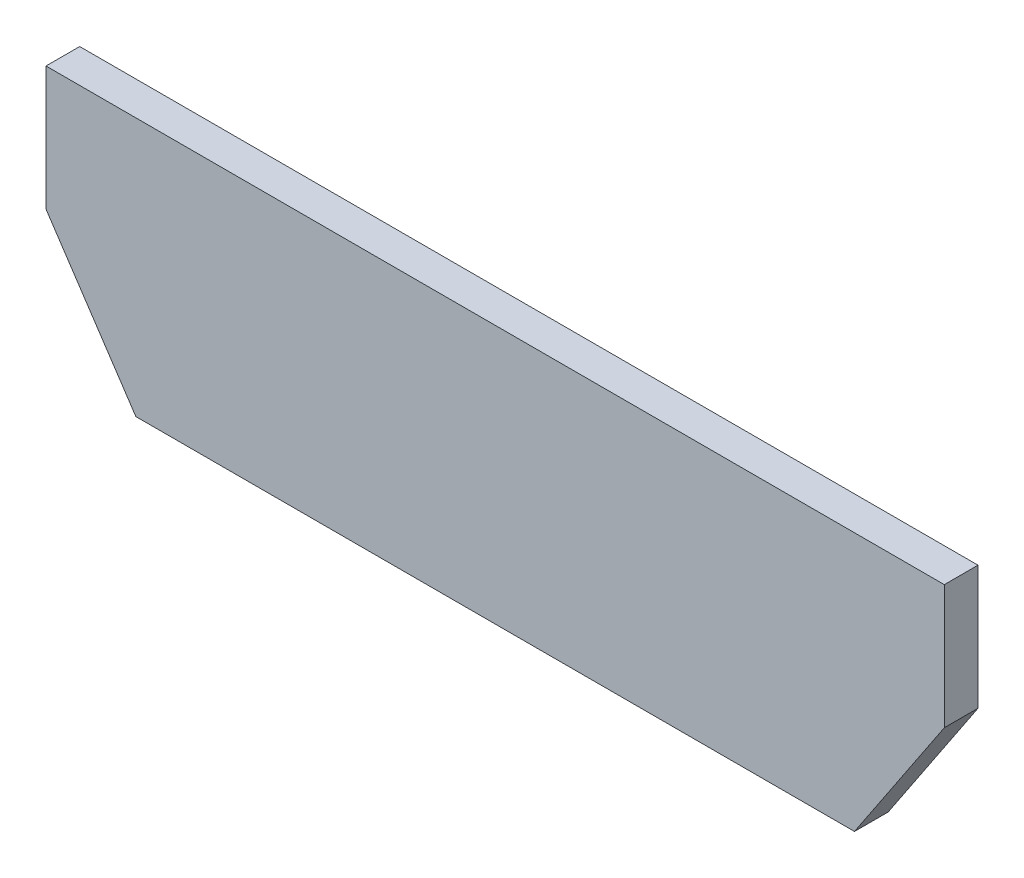
ISO-10303-21;
HEADER;
FILE_DESCRIPTION(('STEP AP214'),'2;1');
FILE_NAME('part.step','',(''),(''),'','','');
FILE_SCHEMA(('AUTOMOTIVE_DESIGN { 1 0 10303 214 1 1 1 1 }'));
ENDSEC;
DATA;
#1=APPLICATION_CONTEXT('core data for automotive mechanical design processes');
#2=APPLICATION_PROTOCOL_DEFINITION('international standard','automotive_design',2000,#1);
#3=PRODUCT_CONTEXT('',#1,'mechanical');
#4=PRODUCT('Part','Part','',(#3));
#5=PRODUCT_RELATED_PRODUCT_CATEGORY('part','',(#4));
#6=PRODUCT_DEFINITION_FORMATION('','',#4);
#7=PRODUCT_DEFINITION_CONTEXT('part definition',#1,'design');
#8=PRODUCT_DEFINITION('design','',#6,#7);
#9=PRODUCT_DEFINITION_SHAPE('','',#8);
#10=(LENGTH_UNIT() NAMED_UNIT(*) SI_UNIT(.MILLI.,.METRE.));
#11=(NAMED_UNIT(*) PLANE_ANGLE_UNIT() SI_UNIT($,.RADIAN.));
#12=(NAMED_UNIT(*) SI_UNIT($,.STERADIAN.) SOLID_ANGLE_UNIT());
#13=UNCERTAINTY_MEASURE_WITH_UNIT(LENGTH_MEASURE(1.E-05),#10,'distance_accuracy_value','');
#14=(GEOMETRIC_REPRESENTATION_CONTEXT(3) GLOBAL_UNCERTAINTY_ASSIGNED_CONTEXT((#13)) GLOBAL_UNIT_ASSIGNED_CONTEXT((#10,
#11,#12)) REPRESENTATION_CONTEXT('',''));
#15=CARTESIAN_POINT('',(0.,0.,0.));
#16=DIRECTION('',(0.,0.,1.));
#17=DIRECTION('',(1.,0.,0.));
#18=AXIS2_PLACEMENT_3D('',#15,#16,#17);
#19=CARTESIAN_POINT('',(22.2250000000006,2.286,4.7625));
#20=DIRECTION('',(0.,1.,0.));
#21=DIRECTION('',(-1.,0.,0.));
#22=AXIS2_PLACEMENT_3D('',#19,#20,#21);
#23=PLANE('',#22);
#24=DIRECTION('',(1.,0.,0.));
#25=VECTOR('',#24,1.);
#26=CARTESIAN_POINT('',(22.2250000000006,2.286,0.));
#27=LINE('',#26,#25);
#28=CARTESIAN_POINT('',(22.2250000000006,2.286,0.));
#29=VERTEX_POINT('',#28);
#30=CARTESIAN_POINT('',(123.825000000001,2.286,0.));
#31=VERTEX_POINT('',#30);
#32=EDGE_CURVE('E124',#29,#31,#27,.T.);
#33=ORIENTED_EDGE('',*,*,#32,.T.);
#34=DIRECTION('',(0.,0.,-1.));
#35=VECTOR('',#34,1.);
#36=CARTESIAN_POINT('',(123.825000000001,2.286,4.7625));
#37=LINE('',#36,#35);
#38=CARTESIAN_POINT('',(123.825000000001,2.286,4.7625));
#39=VERTEX_POINT('',#38);
#40=EDGE_CURVE('E11',#39,#31,#37,.T.);
#41=ORIENTED_EDGE('',*,*,#40,.F.);
#42=DIRECTION('',(1.,0.,0.));
#43=VECTOR('',#42,1.);
#44=CARTESIAN_POINT('',(22.2250000000006,2.286,4.7625));
#45=LINE('',#44,#43);
#46=CARTESIAN_POINT('',(22.2250000000006,2.286,4.7625));
#47=VERTEX_POINT('',#46);
#48=EDGE_CURVE('E134',#47,#39,#45,.T.);
#49=ORIENTED_EDGE('',*,*,#48,.F.);
#50=DIRECTION('',(0.,0.,-1.));
#51=VECTOR('',#50,1.);
#52=CARTESIAN_POINT('',(22.2250000000006,2.286,4.7625));
#53=LINE('',#52,#51);
#54=EDGE_CURVE('E120',#47,#29,#53,.T.);
#55=ORIENTED_EDGE('',*,*,#54,.T.);
#56=EDGE_LOOP('',(#33,#41,#49,#55));
#57=FACE_BOUND('',#56,.T.);
#58=ADVANCED_FACE('F40',(#57),#23,.F.);
#59=CARTESIAN_POINT('',(123.825000000001,2.286,4.7625));
#60=DIRECTION('',(-0.832050294337846,0.554700196225225,0.));
#61=DIRECTION('',(-0.554700196225225,-0.832050294337846,0.));
#62=AXIS2_PLACEMENT_3D('',#59,#60,#61);
#63=PLANE('',#62);
#64=DIRECTION('',(0.554700196225225,0.832050294337846,0.));
#65=VECTOR('',#64,1.);
#66=CARTESIAN_POINT('',(123.825000000001,2.286,0.));
#67=LINE('',#66,#65);
#68=CARTESIAN_POINT('',(136.525,21.336,0.));
#69=VERTEX_POINT('',#68);
#70=EDGE_CURVE('E127',#31,#69,#67,.T.);
#71=ORIENTED_EDGE('',*,*,#70,.T.);
#72=DIRECTION('',(0.,0.,-1.));
#73=VECTOR('',#72,1.);
#74=CARTESIAN_POINT('',(136.525,21.336,4.7625));
#75=LINE('',#74,#73);
#76=CARTESIAN_POINT('',(136.525,21.336,4.7625));
#77=VERTEX_POINT('',#76);
#78=EDGE_CURVE('E48',#77,#69,#75,.T.);
#79=ORIENTED_EDGE('',*,*,#78,.F.);
#80=DIRECTION('',(0.554700196225225,0.832050294337846,0.));
#81=VECTOR('',#80,1.);
#82=CARTESIAN_POINT('',(123.825000000001,2.286,4.7625));
#83=LINE('',#82,#81);
#84=EDGE_CURVE('E93',#39,#77,#83,.T.);
#85=ORIENTED_EDGE('',*,*,#84,.F.);
#86=ORIENTED_EDGE('',*,*,#40,.T.);
#87=EDGE_LOOP('',(#71,#79,#85,#86));
#88=FACE_BOUND('',#87,.T.);
#89=ADVANCED_FACE('F158',(#88),#63,.F.);
#90=CARTESIAN_POINT('',(136.525,21.336,4.7625));
#91=DIRECTION('',(-1.,0.,0.));
#92=DIRECTION('',(0.,-1.,0.));
#93=AXIS2_PLACEMENT_3D('',#90,#91,#92);
#94=PLANE('',#93);
#95=DIRECTION('',(0.,1.,0.));
#96=VECTOR('',#95,1.);
#97=CARTESIAN_POINT('',(136.525,21.336,0.));
#98=LINE('',#97,#96);
#99=CARTESIAN_POINT('',(136.525,38.862,0.));
#100=VERTEX_POINT('',#99);
#101=EDGE_CURVE('E129',#69,#100,#98,.T.);
#102=ORIENTED_EDGE('',*,*,#101,.T.);
#103=DIRECTION('',(0.,0.,-1.));
#104=VECTOR('',#103,1.);
#105=CARTESIAN_POINT('',(136.525,38.862,4.7625));
#106=LINE('',#105,#104);
#107=CARTESIAN_POINT('',(136.525,38.862,4.7625));
#108=VERTEX_POINT('',#107);
#109=EDGE_CURVE('E115',#108,#100,#106,.T.);
#110=ORIENTED_EDGE('',*,*,#109,.F.);
#111=DIRECTION('',(0.,1.,0.));
#112=VECTOR('',#111,1.);
#113=CARTESIAN_POINT('',(136.525,21.336,4.7625));
#114=LINE('',#113,#112);
#115=EDGE_CURVE('E106',#77,#108,#114,.T.);
#116=ORIENTED_EDGE('',*,*,#115,.F.);
#117=ORIENTED_EDGE('',*,*,#78,.T.);
#118=EDGE_LOOP('',(#102,#110,#116,#117));
#119=FACE_BOUND('',#118,.T.);
#120=ADVANCED_FACE('F140',(#119),#94,.F.);
#121=CARTESIAN_POINT('',(136.525,38.862,4.7625));
#122=DIRECTION('',(0.,-1.,0.));
#123=DIRECTION('',(1.,0.,0.));
#124=AXIS2_PLACEMENT_3D('',#121,#122,#123);
#125=PLANE('',#124);
#126=DIRECTION('',(-1.,0.,0.));
#127=VECTOR('',#126,1.);
#128=CARTESIAN_POINT('',(136.525,38.862,0.));
#129=LINE('',#128,#127);
#130=CARTESIAN_POINT('',(9.52500000000044,38.862,0.));
#131=VERTEX_POINT('',#130);
#132=EDGE_CURVE('E114',#100,#131,#129,.T.);
#133=ORIENTED_EDGE('',*,*,#132,.T.);
#134=DIRECTION('',(0.,0.,-1.));
#135=VECTOR('',#134,1.);
#136=CARTESIAN_POINT('',(9.52500000000044,38.862,4.7625));
#137=LINE('',#136,#135);
#138=CARTESIAN_POINT('',(9.52500000000044,38.862,4.7625));
#139=VERTEX_POINT('',#138);
#140=EDGE_CURVE('E111',#139,#131,#137,.T.);
#141=ORIENTED_EDGE('',*,*,#140,.F.);
#142=DIRECTION('',(-1.,0.,0.));
#143=VECTOR('',#142,1.);
#144=CARTESIAN_POINT('',(136.525,38.862,4.7625));
#145=LINE('',#144,#143);
#146=EDGE_CURVE('E100',#108,#139,#145,.T.);
#147=ORIENTED_EDGE('',*,*,#146,.F.);
#148=ORIENTED_EDGE('',*,*,#109,.T.);
#149=EDGE_LOOP('',(#133,#141,#147,#148));
#150=FACE_BOUND('',#149,.T.);
#151=ADVANCED_FACE('F112',(#150),#125,.F.);
#152=CARTESIAN_POINT('',(9.52500000000044,38.862,4.7625));
#153=DIRECTION('',(1.,0.,0.));
#154=DIRECTION('',(0.,1.,0.));
#155=AXIS2_PLACEMENT_3D('',#152,#153,#154);
#156=PLANE('',#155);
#157=DIRECTION('',(0.,-1.,0.));
#158=VECTOR('',#157,1.);
#159=CARTESIAN_POINT('',(9.52500000000044,38.862,0.));
#160=LINE('',#159,#158);
#161=CARTESIAN_POINT('',(9.52500000000039,21.336,0.));
#162=VERTEX_POINT('',#161);
#163=EDGE_CURVE('E79',#131,#162,#160,.T.);
#164=ORIENTED_EDGE('',*,*,#163,.T.);
#165=DIRECTION('',(0.,0.,-1.));
#166=VECTOR('',#165,1.);
#167=CARTESIAN_POINT('',(9.52500000000039,21.336,4.7625));
#168=LINE('',#167,#166);
#169=CARTESIAN_POINT('',(9.52500000000039,21.336,4.7625));
#170=VERTEX_POINT('',#169);
#171=EDGE_CURVE('E116',#170,#162,#168,.T.);
#172=ORIENTED_EDGE('',*,*,#171,.F.);
#173=DIRECTION('',(0.,-1.,0.));
#174=VECTOR('',#173,1.);
#175=CARTESIAN_POINT('',(9.52500000000044,38.862,4.7625));
#176=LINE('',#175,#174);
#177=EDGE_CURVE('E104',#139,#170,#176,.T.);
#178=ORIENTED_EDGE('',*,*,#177,.F.);
#179=ORIENTED_EDGE('',*,*,#140,.T.);
#180=EDGE_LOOP('',(#164,#172,#178,#179));
#181=FACE_BOUND('',#180,.T.);
#182=ADVANCED_FACE('F118',(#181),#156,.F.);
#183=CARTESIAN_POINT('',(9.52500000000039,21.336,4.7625));
#184=DIRECTION('',(0.83205029433784,0.554700196225235,0.));
#185=DIRECTION('',(-0.554700196225235,0.83205029433784,0.));
#186=AXIS2_PLACEMENT_3D('',#183,#184,#185);
#187=PLANE('',#186);
#188=DIRECTION('',(0.554700196225235,-0.83205029433784,0.));
#189=VECTOR('',#188,1.);
#190=CARTESIAN_POINT('',(9.52500000000039,21.336,0.));
#191=LINE('',#190,#189);
#192=EDGE_CURVE('E85',#162,#29,#191,.T.);
#193=ORIENTED_EDGE('',*,*,#192,.T.);
#194=ORIENTED_EDGE('',*,*,#54,.F.);
#195=DIRECTION('',(0.554700196225235,-0.83205029433784,0.));
#196=VECTOR('',#195,1.);
#197=CARTESIAN_POINT('',(9.52500000000039,21.336,4.7625));
#198=LINE('',#197,#196);
#199=EDGE_CURVE('E56',#170,#47,#198,.T.);
#200=ORIENTED_EDGE('',*,*,#199,.F.);
#201=ORIENTED_EDGE('',*,*,#171,.T.);
#202=EDGE_LOOP('',(#193,#194,#200,#201));
#203=FACE_BOUND('',#202,.T.);
#204=ADVANCED_FACE('F147',(#203),#187,.F.);
#205=CARTESIAN_POINT('',(0.,0.,4.7625));
#206=DIRECTION('',(0.,0.,1.));
#207=DIRECTION('',(1.,0.,0.));
#208=AXIS2_PLACEMENT_3D('',#205,#206,#207);
#209=PLANE('',#208);
#210=ORIENTED_EDGE('',*,*,#48,.T.);
#211=ORIENTED_EDGE('',*,*,#84,.T.);
#212=ORIENTED_EDGE('',*,*,#115,.T.);
#213=ORIENTED_EDGE('',*,*,#146,.T.);
#214=ORIENTED_EDGE('',*,*,#177,.T.);
#215=ORIENTED_EDGE('',*,*,#199,.T.);
#216=EDGE_LOOP('',(#210,#211,#212,#213,#214,#215));
#217=FACE_BOUND('',#216,.T.);
#218=ADVANCED_FACE('F102',(#217),#209,.T.);
#219=CARTESIAN_POINT('',(0.,0.,0.));
#220=DIRECTION('',(0.,0.,1.));
#221=DIRECTION('',(1.,0.,0.));
#222=AXIS2_PLACEMENT_3D('',#219,#220,#221);
#223=PLANE('',#222);
#224=ORIENTED_EDGE('',*,*,#32,.F.);
#225=ORIENTED_EDGE('',*,*,#192,.F.);
#226=ORIENTED_EDGE('',*,*,#163,.F.);
#227=ORIENTED_EDGE('',*,*,#132,.F.);
#228=ORIENTED_EDGE('',*,*,#101,.F.);
#229=ORIENTED_EDGE('',*,*,#70,.F.);
#230=EDGE_LOOP('',(#224,#225,#226,#227,#228,#229));
#231=FACE_BOUND('',#230,.T.);
#232=ADVANCED_FACE('F143',(#231),#223,.F.);
#233=CLOSED_SHELL('',(#58,#89,#120,#151,#182,#204,#218,#232));
#234=MANIFOLD_SOLID_BREP('B2',#233);
#235=ADVANCED_BREP_SHAPE_REPRESENTATION('',(#18,#234),#14);
#236=SHAPE_DEFINITION_REPRESENTATION(#9,#235);
ENDSEC;
END-ISO-10303-21;
